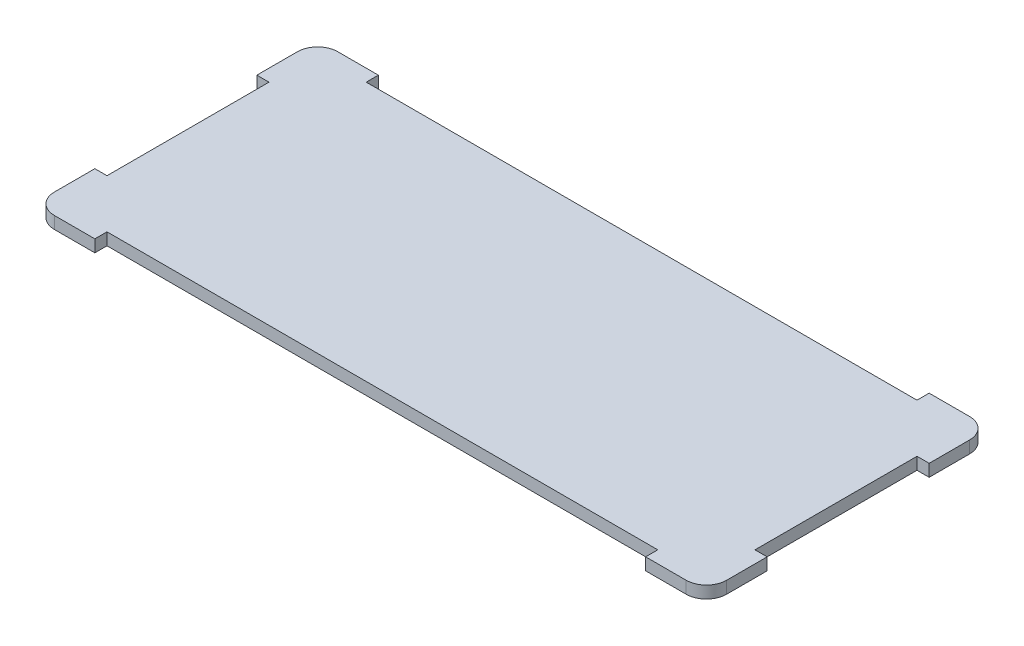
ISO-10303-21;
HEADER;
FILE_DESCRIPTION(('STEP AP214'),'2;1');
FILE_NAME('part.step','',(''),(''),'','','');
FILE_SCHEMA(('AUTOMOTIVE_DESIGN { 1 0 10303 214 1 1 1 1 }'));
ENDSEC;
DATA;
#1=APPLICATION_CONTEXT('core data for automotive mechanical design processes');
#2=APPLICATION_PROTOCOL_DEFINITION('international standard','automotive_design',2000,#1);
#3=PRODUCT_CONTEXT('',#1,'mechanical');
#4=PRODUCT('Part','Part','',(#3));
#5=PRODUCT_RELATED_PRODUCT_CATEGORY('part','',(#4));
#6=PRODUCT_DEFINITION_FORMATION('','',#4);
#7=PRODUCT_DEFINITION_CONTEXT('part definition',#1,'design');
#8=PRODUCT_DEFINITION('design','',#6,#7);
#9=PRODUCT_DEFINITION_SHAPE('','',#8);
#10=(LENGTH_UNIT() NAMED_UNIT(*) SI_UNIT(.MILLI.,.METRE.));
#11=(NAMED_UNIT(*) PLANE_ANGLE_UNIT() SI_UNIT($,.RADIAN.));
#12=(NAMED_UNIT(*) SI_UNIT($,.STERADIAN.) SOLID_ANGLE_UNIT());
#13=UNCERTAINTY_MEASURE_WITH_UNIT(LENGTH_MEASURE(1.E-05),#10,'distance_accuracy_value','');
#14=(GEOMETRIC_REPRESENTATION_CONTEXT(3) GLOBAL_UNCERTAINTY_ASSIGNED_CONTEXT((#13)) GLOBAL_UNIT_ASSIGNED_CONTEXT((#10,
#11,#12)) REPRESENTATION_CONTEXT('',''));
#15=CARTESIAN_POINT('',(0.,0.,0.));
#16=DIRECTION('',(0.,0.,1.));
#17=DIRECTION('',(1.,0.,0.));
#18=AXIS2_PLACEMENT_3D('',#15,#16,#17);
#19=CARTESIAN_POINT('',(-83.3544303797468,-0.0100000000000031,19.1518987341772));
#20=DIRECTION('',(0.,0.,-1.));
#21=DIRECTION('',(-1.,0.,0.));
#22=AXIS2_PLACEMENT_3D('',#19,#20,#21);
#23=PLANE('',#22);
#24=DIRECTION('',(0.,1.,0.));
#25=VECTOR('',#24,1.);
#26=CARTESIAN_POINT('',(52.6371308016878,-0.0100000000000031,19.1518987341772));
#27=LINE('',#26,#25);
#28=CARTESIAN_POINT('',(52.6371308016878,0.,19.1518987341772));
#29=VERTEX_POINT('',#28);
#30=CARTESIAN_POINT('',(52.6371308016878,3.,19.1518987341772));
#31=VERTEX_POINT('',#30);
#32=EDGE_CURVE('E36',#29,#31,#27,.T.);
#33=ORIENTED_EDGE('',*,*,#32,.T.);
#34=DIRECTION('',(-1.,0.,0.));
#35=VECTOR('',#34,1.);
#36=CARTESIAN_POINT('',(0.,3.,19.1518987341772));
#37=LINE('',#36,#35);
#38=CARTESIAN_POINT('',(-83.3544303797468,3.,19.1518987341772));
#39=VERTEX_POINT('',#38);
#40=EDGE_CURVE('E288',#31,#39,#37,.T.);
#41=ORIENTED_EDGE('',*,*,#40,.T.);
#42=DIRECTION('',(0.,1.,0.));
#43=VECTOR('',#42,1.);
#44=CARTESIAN_POINT('',(-83.3544303797468,-0.0100000000000031,19.1518987341772));
#45=LINE('',#44,#43);
#46=CARTESIAN_POINT('',(-83.3544303797468,0.,19.1518987341772));
#47=VERTEX_POINT('',#46);
#48=EDGE_CURVE('E253',#47,#39,#45,.T.);
#49=ORIENTED_EDGE('',*,*,#48,.F.);
#50=DIRECTION('',(-1.,0.,0.));
#51=VECTOR('',#50,1.);
#52=CARTESIAN_POINT('',(0.,0.,19.1518987341772));
#53=LINE('',#52,#51);
#54=EDGE_CURVE('E325',#29,#47,#53,.T.);
#55=ORIENTED_EDGE('',*,*,#54,.F.);
#56=EDGE_LOOP('',(#33,#41,#49,#55));
#57=FACE_BOUND('',#56,.T.);
#58=ADVANCED_FACE('F32',(#57),#23,.F.);
#59=CARTESIAN_POINT('',(52.6371308016878,-0.0100000000000031,22.1518987341772));
#60=DIRECTION('',(1.,0.,0.));
#61=DIRECTION('',(0.,0.,-1.));
#62=AXIS2_PLACEMENT_3D('',#59,#60,#61);
#63=PLANE('',#62);
#64=DIRECTION('',(0.,-1.,0.));
#65=VECTOR('',#64,1.);
#66=CARTESIAN_POINT('',(52.6371308016877,50.,22.1518987341772));
#67=LINE('',#66,#65);
#68=CARTESIAN_POINT('',(52.6371308016877,3.,22.1518987341772));
#69=VERTEX_POINT('',#68);
#70=CARTESIAN_POINT('',(52.6371308016878,0.,22.1518987341772));
#71=VERTEX_POINT('',#70);
#72=EDGE_CURVE('E273',#69,#71,#67,.T.);
#73=ORIENTED_EDGE('',*,*,#72,.F.);
#74=DIRECTION('',(0.,0.,-1.));
#75=VECTOR('',#74,1.);
#76=CARTESIAN_POINT('',(52.6371308016879,3.,2.43495644026E-13));
#77=LINE('',#76,#75);
#78=EDGE_CURVE('E285',#69,#31,#77,.T.);
#79=ORIENTED_EDGE('',*,*,#78,.T.);
#80=ORIENTED_EDGE('',*,*,#32,.F.);
#81=DIRECTION('',(0.,0.,-1.));
#82=VECTOR('',#81,1.);
#83=CARTESIAN_POINT('',(52.6371308016879,0.,2.43495644026E-13));
#84=LINE('',#83,#82);
#85=EDGE_CURVE('E373',#71,#29,#84,.T.);
#86=ORIENTED_EDGE('',*,*,#85,.F.);
#87=EDGE_LOOP('',(#73,#79,#80,#86));
#88=FACE_BOUND('',#87,.T.);
#89=ADVANCED_FACE('F397',(#88),#63,.F.);
#90=CARTESIAN_POINT('',(-83.3544303797468,-0.0100000000000031,22.1518987341772));
#91=DIRECTION('',(-1.,0.,0.));
#92=DIRECTION('',(0.,0.,1.));
#93=AXIS2_PLACEMENT_3D('',#90,#91,#92);
#94=PLANE('',#93);
#95=ORIENTED_EDGE('',*,*,#48,.T.);
#96=DIRECTION('',(0.,0.,1.));
#97=VECTOR('',#96,1.);
#98=CARTESIAN_POINT('',(-83.3544303797468,3.,0.));
#99=LINE('',#98,#97);
#100=CARTESIAN_POINT('',(-83.3544303797468,3.,22.1518987341772));
#101=VERTEX_POINT('',#100);
#102=EDGE_CURVE('E266',#39,#101,#99,.T.);
#103=ORIENTED_EDGE('',*,*,#102,.T.);
#104=DIRECTION('',(0.,1.,0.));
#105=VECTOR('',#104,1.);
#106=CARTESIAN_POINT('',(-83.3544303797468,-0.0100000000000031,22.1518987341772));
#107=LINE('',#106,#105);
#108=CARTESIAN_POINT('',(-83.3544303797468,0.,22.1518987341772));
#109=VERTEX_POINT('',#108);
#110=EDGE_CURVE('E321',#109,#101,#107,.T.);
#111=ORIENTED_EDGE('',*,*,#110,.F.);
#112=DIRECTION('',(0.,0.,1.));
#113=VECTOR('',#112,1.);
#114=CARTESIAN_POINT('',(-83.3544303797468,0.,0.));
#115=LINE('',#114,#113);
#116=EDGE_CURVE('E278',#47,#109,#115,.T.);
#117=ORIENTED_EDGE('',*,*,#116,.F.);
#118=EDGE_LOOP('',(#95,#103,#111,#117));
#119=FACE_BOUND('',#118,.T.);
#120=ADVANCED_FACE('F385',(#119),#94,.F.);
#121=CARTESIAN_POINT('',(64.6371308016878,-0.0100000000000031,7.15189873417722));
#122=DIRECTION('',(0.,0.,1.));
#123=DIRECTION('',(1.,0.,0.));
#124=AXIS2_PLACEMENT_3D('',#121,#122,#123);
#125=PLANE('',#124);
#126=DIRECTION('',(0.,1.,0.));
#127=VECTOR('',#126,1.);
#128=CARTESIAN_POINT('',(64.6371308016878,-0.0100000000000031,7.15189873417722));
#129=LINE('',#128,#127);
#130=CARTESIAN_POINT('',(64.6371308016878,0.,7.15189873417722));
#131=VERTEX_POINT('',#130);
#132=CARTESIAN_POINT('',(64.6371308016878,3.,7.15189873417722));
#133=VERTEX_POINT('',#132);
#134=EDGE_CURVE('E295',#131,#133,#129,.T.);
#135=ORIENTED_EDGE('',*,*,#134,.T.);
#136=DIRECTION('',(1.,0.,0.));
#137=VECTOR('',#136,1.);
#138=CARTESIAN_POINT('',(0.,3.,7.15189873417722));
#139=LINE('',#138,#137);
#140=CARTESIAN_POINT('',(67.6371308016878,3.,7.15189873417722));
#141=VERTEX_POINT('',#140);
#142=EDGE_CURVE('E289',#133,#141,#139,.T.);
#143=ORIENTED_EDGE('',*,*,#142,.T.);
#144=DIRECTION('',(0.,1.,0.));
#145=VECTOR('',#144,1.);
#146=CARTESIAN_POINT('',(67.6371308016878,-0.0100000000000031,7.15189873417722));
#147=LINE('',#146,#145);
#148=CARTESIAN_POINT('',(67.6371308016878,0.,7.15189873417722));
#149=VERTEX_POINT('',#148);
#150=EDGE_CURVE('E247',#149,#141,#147,.T.);
#151=ORIENTED_EDGE('',*,*,#150,.F.);
#152=DIRECTION('',(1.,0.,0.));
#153=VECTOR('',#152,1.);
#154=CARTESIAN_POINT('',(0.,0.,7.15189873417722));
#155=LINE('',#154,#153);
#156=EDGE_CURVE('E322',#131,#149,#155,.T.);
#157=ORIENTED_EDGE('',*,*,#156,.F.);
#158=EDGE_LOOP('',(#135,#143,#151,#157));
#159=FACE_BOUND('',#158,.T.);
#160=ADVANCED_FACE('F412',(#159),#125,.F.);
#161=CARTESIAN_POINT('',(64.6371308016878,-0.0100000000000031,-32.8481012658228));
#162=DIRECTION('',(0.,0.,-1.));
#163=DIRECTION('',(-1.,0.,0.));
#164=AXIS2_PLACEMENT_3D('',#161,#162,#163);
#165=PLANE('',#164);
#166=DIRECTION('',(0.,-1.,0.));
#167=VECTOR('',#166,1.);
#168=CARTESIAN_POINT('',(67.6371308016878,50.,-32.8481012658228));
#169=LINE('',#168,#167);
#170=CARTESIAN_POINT('',(67.6371308016878,3.,-32.8481012658228));
#171=VERTEX_POINT('',#170);
#172=CARTESIAN_POINT('',(67.6371308016878,0.,-32.8481012658228));
#173=VERTEX_POINT('',#172);
#174=EDGE_CURVE('E318',#171,#173,#169,.T.);
#175=ORIENTED_EDGE('',*,*,#174,.F.);
#176=DIRECTION('',(-1.,0.,0.));
#177=VECTOR('',#176,1.);
#178=CARTESIAN_POINT('',(0.,3.,-32.8481012658228));
#179=LINE('',#178,#177);
#180=CARTESIAN_POINT('',(64.6371308016878,3.,-32.8481012658228));
#181=VERTEX_POINT('',#180);
#182=EDGE_CURVE('E241',#171,#181,#179,.T.);
#183=ORIENTED_EDGE('',*,*,#182,.T.);
#184=DIRECTION('',(0.,1.,0.));
#185=VECTOR('',#184,1.);
#186=CARTESIAN_POINT('',(64.6371308016878,-0.0100000000000031,-32.8481012658228));
#187=LINE('',#186,#185);
#188=CARTESIAN_POINT('',(64.6371308016878,0.,-32.8481012658228));
#189=VERTEX_POINT('',#188);
#190=EDGE_CURVE('E220',#189,#181,#187,.T.);
#191=ORIENTED_EDGE('',*,*,#190,.F.);
#192=DIRECTION('',(-1.,0.,0.));
#193=VECTOR('',#192,1.);
#194=CARTESIAN_POINT('',(0.,0.,-32.8481012658228));
#195=LINE('',#194,#193);
#196=EDGE_CURVE('E248',#173,#189,#195,.T.);
#197=ORIENTED_EDGE('',*,*,#196,.F.);
#198=EDGE_LOOP('',(#175,#183,#191,#197));
#199=FACE_BOUND('',#198,.T.);
#200=ADVANCED_FACE('F414',(#199),#165,.F.);
#201=CARTESIAN_POINT('',(64.6371308016878,-0.0100000000000031,7.15189873417722));
#202=DIRECTION('',(-1.,0.,0.));
#203=DIRECTION('',(0.,0.,1.));
#204=AXIS2_PLACEMENT_3D('',#201,#202,#203);
#205=PLANE('',#204);
#206=ORIENTED_EDGE('',*,*,#190,.T.);
#207=DIRECTION('',(0.,0.,1.));
#208=VECTOR('',#207,1.);
#209=CARTESIAN_POINT('',(64.6371308016878,3.,0.));
#210=LINE('',#209,#208);
#211=EDGE_CURVE('E314',#181,#133,#210,.T.);
#212=ORIENTED_EDGE('',*,*,#211,.T.);
#213=ORIENTED_EDGE('',*,*,#134,.F.);
#214=DIRECTION('',(0.,0.,1.));
#215=VECTOR('',#214,1.);
#216=CARTESIAN_POINT('',(64.6371308016878,0.,0.));
#217=LINE('',#216,#215);
#218=EDGE_CURVE('E324',#189,#131,#217,.T.);
#219=ORIENTED_EDGE('',*,*,#218,.F.);
#220=EDGE_LOOP('',(#206,#212,#213,#219));
#221=FACE_BOUND('',#220,.T.);
#222=ADVANCED_FACE('F420',(#221),#205,.F.);
#223=CARTESIAN_POINT('',(52.6371308016878,-0.0100000000000031,-44.8481012658228));
#224=DIRECTION('',(0.,0.,1.));
#225=DIRECTION('',(1.,0.,0.));
#226=AXIS2_PLACEMENT_3D('',#223,#224,#225);
#227=PLANE('',#226);
#228=DIRECTION('',(0.,1.,0.));
#229=VECTOR('',#228,1.);
#230=CARTESIAN_POINT('',(-83.3544303797469,-0.0100000000000031,-44.8481012658228));
#231=LINE('',#230,#229);
#232=CARTESIAN_POINT('',(-83.3544303797469,0.,-44.8481012658228));
#233=VERTEX_POINT('',#232);
#234=CARTESIAN_POINT('',(-83.3544303797469,3.,-44.8481012658228));
#235=VERTEX_POINT('',#234);
#236=EDGE_CURVE('E200',#233,#235,#231,.T.);
#237=ORIENTED_EDGE('',*,*,#236,.T.);
#238=DIRECTION('',(1.,0.,0.));
#239=VECTOR('',#238,1.);
#240=CARTESIAN_POINT('',(0.,3.,-44.8481012658228));
#241=LINE('',#240,#239);
#242=CARTESIAN_POINT('',(52.6371308016878,3.,-44.8481012658228));
#243=VERTEX_POINT('',#242);
#244=EDGE_CURVE('E234',#235,#243,#241,.T.);
#245=ORIENTED_EDGE('',*,*,#244,.T.);
#246=DIRECTION('',(0.,1.,0.));
#247=VECTOR('',#246,1.);
#248=CARTESIAN_POINT('',(52.6371308016878,-0.0100000000000031,-44.8481012658228));
#249=LINE('',#248,#247);
#250=CARTESIAN_POINT('',(52.6371308016878,0.,-44.8481012658228));
#251=VERTEX_POINT('',#250);
#252=EDGE_CURVE('E203',#251,#243,#249,.T.);
#253=ORIENTED_EDGE('',*,*,#252,.F.);
#254=DIRECTION('',(1.,0.,0.));
#255=VECTOR('',#254,1.);
#256=CARTESIAN_POINT('',(0.,0.,-44.8481012658228));
#257=LINE('',#256,#255);
#258=EDGE_CURVE('E196',#233,#251,#257,.T.);
#259=ORIENTED_EDGE('',*,*,#258,.F.);
#260=EDGE_LOOP('',(#237,#245,#253,#259));
#261=FACE_BOUND('',#260,.T.);
#262=ADVANCED_FACE('F198',(#261),#227,.F.);
#263=CARTESIAN_POINT('',(-83.3544303797469,-0.0100000000000031,-44.8481012658228));
#264=DIRECTION('',(-1.,0.,0.));
#265=DIRECTION('',(0.,0.,1.));
#266=AXIS2_PLACEMENT_3D('',#263,#264,#265);
#267=PLANE('',#266);
#268=DIRECTION('',(0.,-1.,0.));
#269=VECTOR('',#268,1.);
#270=CARTESIAN_POINT('',(-83.3544303797469,50.,-47.8481012658228));
#271=LINE('',#270,#269);
#272=CARTESIAN_POINT('',(-83.3544303797469,3.,-47.8481012658228));
#273=VERTEX_POINT('',#272);
#274=CARTESIAN_POINT('',(-83.3544303797469,0.,-47.8481012658228));
#275=VERTEX_POINT('',#274);
#276=EDGE_CURVE('E244',#273,#275,#271,.T.);
#277=ORIENTED_EDGE('',*,*,#276,.F.);
#278=DIRECTION('',(0.,0.,1.));
#279=VECTOR('',#278,1.);
#280=CARTESIAN_POINT('',(-83.3544303797469,3.,0.));
#281=LINE('',#280,#279);
#282=EDGE_CURVE('E218',#273,#235,#281,.T.);
#283=ORIENTED_EDGE('',*,*,#282,.T.);
#284=ORIENTED_EDGE('',*,*,#236,.F.);
#285=DIRECTION('',(0.,0.,1.));
#286=VECTOR('',#285,1.);
#287=CARTESIAN_POINT('',(-83.3544303797469,0.,0.));
#288=LINE('',#287,#286);
#289=EDGE_CURVE('E207',#275,#233,#288,.T.);
#290=ORIENTED_EDGE('',*,*,#289,.F.);
#291=EDGE_LOOP('',(#277,#283,#284,#290));
#292=FACE_BOUND('',#291,.T.);
#293=ADVANCED_FACE('F217',(#292),#267,.F.);
#294=CARTESIAN_POINT('',(52.6371308016878,-0.0100000000000031,-44.8481012658228));
#295=DIRECTION('',(1.,0.,0.));
#296=DIRECTION('',(0.,0.,-1.));
#297=AXIS2_PLACEMENT_3D('',#294,#295,#296);
#298=PLANE('',#297);
#299=ORIENTED_EDGE('',*,*,#252,.T.);
#300=DIRECTION('',(0.,0.,-1.));
#301=VECTOR('',#300,1.);
#302=CARTESIAN_POINT('',(52.6371308016878,3.,0.));
#303=LINE('',#302,#301);
#304=CARTESIAN_POINT('',(52.6371308016878,3.,-47.8481012658228));
#305=VERTEX_POINT('',#304);
#306=EDGE_CURVE('E238',#243,#305,#303,.T.);
#307=ORIENTED_EDGE('',*,*,#306,.T.);
#308=DIRECTION('',(0.,1.,0.));
#309=VECTOR('',#308,1.);
#310=CARTESIAN_POINT('',(52.6371308016878,-0.0100000000000031,-47.8481012658228));
#311=LINE('',#310,#309);
#312=CARTESIAN_POINT('',(52.6371308016878,0.,-47.8481012658228));
#313=VERTEX_POINT('',#312);
#314=EDGE_CURVE('E242',#313,#305,#311,.T.);
#315=ORIENTED_EDGE('',*,*,#314,.F.);
#316=DIRECTION('',(0.,0.,-1.));
#317=VECTOR('',#316,1.);
#318=CARTESIAN_POINT('',(52.6371308016878,0.,0.));
#319=LINE('',#318,#317);
#320=EDGE_CURVE('E215',#251,#313,#319,.T.);
#321=ORIENTED_EDGE('',*,*,#320,.F.);
#322=EDGE_LOOP('',(#299,#307,#315,#321));
#323=FACE_BOUND('',#322,.T.);
#324=ADVANCED_FACE('F567',(#323),#298,.F.);
#325=CARTESIAN_POINT('',(-98.3544303797468,-0.0100000000000031,7.15189873417722));
#326=DIRECTION('',(0.,0.,1.));
#327=DIRECTION('',(1.,0.,0.));
#328=AXIS2_PLACEMENT_3D('',#325,#326,#327);
#329=PLANE('',#328);
#330=DIRECTION('',(0.,-1.,0.));
#331=VECTOR('',#330,1.);
#332=CARTESIAN_POINT('',(-98.3544303797468,50.,7.15189873417722));
#333=LINE('',#332,#331);
#334=CARTESIAN_POINT('',(-98.3544303797468,3.,7.15189873417722));
#335=VERTEX_POINT('',#334);
#336=CARTESIAN_POINT('',(-98.3544303797468,0.,7.15189873417722));
#337=VERTEX_POINT('',#336);
#338=EDGE_CURVE('E206',#335,#337,#333,.T.);
#339=ORIENTED_EDGE('',*,*,#338,.F.);
#340=DIRECTION('',(1.,0.,0.));
#341=VECTOR('',#340,1.);
#342=CARTESIAN_POINT('',(0.,3.,7.15189873417733));
#343=LINE('',#342,#341);
#344=CARTESIAN_POINT('',(-95.3544303797468,3.,7.15189873417722));
#345=VERTEX_POINT('',#344);
#346=EDGE_CURVE('E245',#335,#345,#343,.T.);
#347=ORIENTED_EDGE('',*,*,#346,.T.);
#348=DIRECTION('',(0.,1.,0.));
#349=VECTOR('',#348,1.);
#350=CARTESIAN_POINT('',(-95.3544303797468,-0.0100000000000031,7.15189873417722));
#351=LINE('',#350,#349);
#352=CARTESIAN_POINT('',(-95.3544303797468,0.,7.15189873417722));
#353=VERTEX_POINT('',#352);
#354=EDGE_CURVE('E236',#353,#345,#351,.T.);
#355=ORIENTED_EDGE('',*,*,#354,.F.);
#356=DIRECTION('',(1.,0.,0.));
#357=VECTOR('',#356,1.);
#358=CARTESIAN_POINT('',(0.,0.,7.15189873417733));
#359=LINE('',#358,#357);
#360=EDGE_CURVE('E270',#337,#353,#359,.T.);
#361=ORIENTED_EDGE('',*,*,#360,.F.);
#362=EDGE_LOOP('',(#339,#347,#355,#361));
#363=FACE_BOUND('',#362,.T.);
#364=ADVANCED_FACE('F462',(#363),#329,.F.);
#365=CARTESIAN_POINT('',(-98.3544303797468,-0.0100000000000031,-32.8481012658228));
#366=DIRECTION('',(0.,0.,-1.));
#367=DIRECTION('',(-1.,0.,0.));
#368=AXIS2_PLACEMENT_3D('',#365,#366,#367);
#369=PLANE('',#368);
#370=DIRECTION('',(0.,1.,0.));
#371=VECTOR('',#370,1.);
#372=CARTESIAN_POINT('',(-95.3544303797468,-0.0100000000000031,-32.8481012658228));
#373=LINE('',#372,#371);
#374=CARTESIAN_POINT('',(-95.3544303797468,0.,-32.8481012658228));
#375=VERTEX_POINT('',#374);
#376=CARTESIAN_POINT('',(-95.3544303797468,3.,-32.8481012658228));
#377=VERTEX_POINT('',#376);
#378=EDGE_CURVE('E250',#375,#377,#373,.T.);
#379=ORIENTED_EDGE('',*,*,#378,.T.);
#380=DIRECTION('',(-1.,0.,0.));
#381=VECTOR('',#380,1.);
#382=CARTESIAN_POINT('',(0.,3.,-32.8481012658228));
#383=LINE('',#382,#381);
#384=CARTESIAN_POINT('',(-98.3544303797468,3.,-32.8481012658228));
#385=VERTEX_POINT('',#384);
#386=EDGE_CURVE('E262',#377,#385,#383,.T.);
#387=ORIENTED_EDGE('',*,*,#386,.T.);
#388=DIRECTION('',(0.,1.,0.));
#389=VECTOR('',#388,1.);
#390=CARTESIAN_POINT('',(-98.3544303797468,50.,-32.8481012658228));
#391=LINE('',#390,#389);
#392=CARTESIAN_POINT('',(-98.3544303797468,0.,-32.8481012658228));
#393=VERTEX_POINT('',#392);
#394=EDGE_CURVE('E280',#393,#385,#391,.T.);
#395=ORIENTED_EDGE('',*,*,#394,.F.);
#396=DIRECTION('',(-1.,0.,0.));
#397=VECTOR('',#396,1.);
#398=CARTESIAN_POINT('',(0.,0.,-32.8481012658228));
#399=LINE('',#398,#397);
#400=EDGE_CURVE('E276',#375,#393,#399,.T.);
#401=ORIENTED_EDGE('',*,*,#400,.F.);
#402=EDGE_LOOP('',(#379,#387,#395,#401));
#403=FACE_BOUND('',#402,.T.);
#404=ADVANCED_FACE('F456',(#403),#369,.F.);
#405=CARTESIAN_POINT('',(-95.3544303797468,-0.0100000000000031,-32.8481012658228));
#406=DIRECTION('',(1.,0.,0.));
#407=DIRECTION('',(0.,0.,-1.));
#408=AXIS2_PLACEMENT_3D('',#405,#406,#407);
#409=PLANE('',#408);
#410=ORIENTED_EDGE('',*,*,#354,.T.);
#411=DIRECTION('',(0.,0.,-1.));
#412=VECTOR('',#411,1.);
#413=CARTESIAN_POINT('',(-95.3544303797468,3.,0.));
#414=LINE('',#413,#412);
#415=EDGE_CURVE('E265',#345,#377,#414,.T.);
#416=ORIENTED_EDGE('',*,*,#415,.T.);
#417=ORIENTED_EDGE('',*,*,#378,.F.);
#418=DIRECTION('',(0.,0.,-1.));
#419=VECTOR('',#418,1.);
#420=CARTESIAN_POINT('',(-95.3544303797468,0.,0.));
#421=LINE('',#420,#419);
#422=EDGE_CURVE('E272',#353,#375,#421,.T.);
#423=ORIENTED_EDGE('',*,*,#422,.F.);
#424=EDGE_LOOP('',(#410,#416,#417,#423));
#425=FACE_BOUND('',#424,.T.);
#426=ADVANCED_FACE('F451',(#425),#409,.F.);
#427=CARTESIAN_POINT('',(-98.3544303797468,50.,22.1518987341772));
#428=DIRECTION('',(0.,0.,-1.));
#429=DIRECTION('',(-1.,0.,0.));
#430=AXIS2_PLACEMENT_3D('',#427,#428,#429);
#431=PLANE('',#430);
#432=DIRECTION('',(1.,0.,0.));
#433=VECTOR('',#432,1.);
#434=CARTESIAN_POINT('',(-98.3544303797468,0.,22.1518987341772));
#435=LINE('',#434,#433);
#436=CARTESIAN_POINT('',(-93.3544303797468,0.,22.1518987341772));
#437=VERTEX_POINT('',#436);
#438=EDGE_CURVE('E329',#437,#109,#435,.T.);
#439=ORIENTED_EDGE('',*,*,#438,.T.);
#440=ORIENTED_EDGE('',*,*,#110,.T.);
#441=DIRECTION('',(-1.,0.,0.));
#442=VECTOR('',#441,1.);
#443=CARTESIAN_POINT('',(-98.3544303797468,3.,22.1518987341772));
#444=LINE('',#443,#442);
#445=CARTESIAN_POINT('',(-93.3544303797468,3.,22.1518987341772));
#446=VERTEX_POINT('',#445);
#447=EDGE_CURVE('E312',#101,#446,#444,.T.);
#448=ORIENTED_EDGE('',*,*,#447,.T.);
#449=DIRECTION('',(0.,-1.,0.));
#450=VECTOR('',#449,1.);
#451=CARTESIAN_POINT('',(-93.3544303797468,50.,22.1518987341772));
#452=LINE('',#451,#450);
#453=EDGE_CURVE('E354',#446,#437,#452,.T.);
#454=ORIENTED_EDGE('',*,*,#453,.T.);
#455=EDGE_LOOP('',(#439,#440,#448,#454));
#456=FACE_BOUND('',#455,.T.);
#457=ADVANCED_FACE('F381',(#456),#431,.F.);
#458=CARTESIAN_POINT('',(62.6371308016878,3.,22.1518987341772));
#459=VERTEX_POINT('',#458);
#460=EDGE_CURVE('E362',#459,#69,#444,.T.);
#461=ORIENTED_EDGE('',*,*,#460,.T.);
#462=ORIENTED_EDGE('',*,*,#72,.T.);
#463=CARTESIAN_POINT('',(62.6371308016878,0.,22.1518987341772));
#464=VERTEX_POINT('',#463);
#465=EDGE_CURVE('E256',#71,#464,#435,.T.);
#466=ORIENTED_EDGE('',*,*,#465,.T.);
#467=DIRECTION('',(0.,-1.,0.));
#468=VECTOR('',#467,1.);
#469=CARTESIAN_POINT('',(62.6371308016878,50.,22.1518987341772));
#470=LINE('',#469,#468);
#471=EDGE_CURVE('E356',#464,#459,#470,.F.);
#472=ORIENTED_EDGE('',*,*,#471,.T.);
#473=EDGE_LOOP('',(#461,#462,#466,#472));
#474=FACE_BOUND('',#473,.T.);
#475=ADVANCED_FACE('F400',(#474),#431,.F.);
#476=CARTESIAN_POINT('',(62.6371308016878,50.,17.1518987341772));
#477=DIRECTION('',(0.,-1.,0.));
#478=DIRECTION('',(0.,0.,-1.));
#479=AXIS2_PLACEMENT_3D('',#476,#477,#478);
#480=CYLINDRICAL_SURFACE('',#479,5.);
#481=CARTESIAN_POINT('',(62.6371308016878,3.,17.1518987341772));
#482=DIRECTION('',(0.,-1.,0.));
#483=DIRECTION('',(0.,0.,-1.));
#484=AXIS2_PLACEMENT_3D('',#481,#482,#483);
#485=CIRCLE('',#484,5.);
#486=CARTESIAN_POINT('',(67.6371308016878,3.,17.1518987341772));
#487=VERTEX_POINT('',#486);
#488=EDGE_CURVE('E361',#459,#487,#485,.F.);
#489=ORIENTED_EDGE('',*,*,#488,.F.);
#490=ORIENTED_EDGE('',*,*,#471,.F.);
#491=CARTESIAN_POINT('',(62.6371308016878,0.,17.1518987341772));
#492=DIRECTION('',(0.,1.,0.));
#493=DIRECTION('',(0.,0.,1.));
#494=AXIS2_PLACEMENT_3D('',#491,#492,#493);
#495=CIRCLE('',#494,5.);
#496=CARTESIAN_POINT('',(67.6371308016878,0.,17.1518987341772));
#497=VERTEX_POINT('',#496);
#498=EDGE_CURVE('E336',#497,#464,#495,.F.);
#499=ORIENTED_EDGE('',*,*,#498,.F.);
#500=DIRECTION('',(0.,-1.,0.));
#501=VECTOR('',#500,1.);
#502=CARTESIAN_POINT('',(67.6371308016878,50.,17.1518987341772));
#503=LINE('',#502,#501);
#504=EDGE_CURVE('E349',#487,#497,#503,.T.);
#505=ORIENTED_EDGE('',*,*,#504,.F.);
#506=EDGE_LOOP('',(#489,#490,#499,#505));
#507=FACE_BOUND('',#506,.T.);
#508=ADVANCED_FACE('F404',(#507),#480,.T.);
#509=CARTESIAN_POINT('',(67.6371308016878,50.,-47.8481012658228));
#510=DIRECTION('',(-1.,0.,0.));
#511=DIRECTION('',(0.,0.,1.));
#512=AXIS2_PLACEMENT_3D('',#509,#510,#511);
#513=PLANE('',#512);
#514=DIRECTION('',(0.,0.,-1.));
#515=VECTOR('',#514,1.);
#516=CARTESIAN_POINT('',(67.6371308016878,0.,-47.8481012658228));
#517=LINE('',#516,#515);
#518=EDGE_CURVE('E305',#497,#149,#517,.T.);
#519=ORIENTED_EDGE('',*,*,#518,.T.);
#520=ORIENTED_EDGE('',*,*,#150,.T.);
#521=DIRECTION('',(0.,0.,1.));
#522=VECTOR('',#521,1.);
#523=CARTESIAN_POINT('',(67.6371308016878,3.,-47.8481012658228));
#524=LINE('',#523,#522);
#525=EDGE_CURVE('E233',#141,#487,#524,.T.);
#526=ORIENTED_EDGE('',*,*,#525,.T.);
#527=ORIENTED_EDGE('',*,*,#504,.T.);
#528=EDGE_LOOP('',(#519,#520,#526,#527));
#529=FACE_BOUND('',#528,.T.);
#530=ADVANCED_FACE('F410',(#529),#513,.F.);
#531=CARTESIAN_POINT('',(67.6371308016878,3.,-42.8481012658228));
#532=VERTEX_POINT('',#531);
#533=EDGE_CURVE('E309',#532,#171,#524,.T.);
#534=ORIENTED_EDGE('',*,*,#533,.T.);
#535=ORIENTED_EDGE('',*,*,#174,.T.);
#536=CARTESIAN_POINT('',(67.6371308016878,0.,-42.8481012658228));
#537=VERTEX_POINT('',#536);
#538=EDGE_CURVE('E308',#173,#537,#517,.T.);
#539=ORIENTED_EDGE('',*,*,#538,.T.);
#540=DIRECTION('',(0.,-1.,0.));
#541=VECTOR('',#540,1.);
#542=CARTESIAN_POINT('',(67.6371308016878,50.,-42.8481012658228));
#543=LINE('',#542,#541);
#544=EDGE_CURVE('E351',#537,#532,#543,.F.);
#545=ORIENTED_EDGE('',*,*,#544,.T.);
#546=EDGE_LOOP('',(#534,#535,#539,#545));
#547=FACE_BOUND('',#546,.T.);
#548=ADVANCED_FACE('F443',(#547),#513,.F.);
#549=CARTESIAN_POINT('',(62.6371308016877,50.,-42.8481012658228));
#550=DIRECTION('',(0.,-1.,0.));
#551=DIRECTION('',(0.,0.,-1.));
#552=AXIS2_PLACEMENT_3D('',#549,#550,#551);
#553=CYLINDRICAL_SURFACE('',#552,5.);
#554=CARTESIAN_POINT('',(62.6371308016877,3.,-42.8481012658228));
#555=DIRECTION('',(0.,-1.,0.));
#556=DIRECTION('',(0.,0.,-1.));
#557=AXIS2_PLACEMENT_3D('',#554,#555,#556);
#558=CIRCLE('',#557,5.);
#559=CARTESIAN_POINT('',(62.6371308016877,3.,-47.8481012658228));
#560=VERTEX_POINT('',#559);
#561=EDGE_CURVE('E367',#532,#560,#558,.F.);
#562=ORIENTED_EDGE('',*,*,#561,.F.);
#563=ORIENTED_EDGE('',*,*,#544,.F.);
#564=CARTESIAN_POINT('',(62.6371308016877,0.,-42.8481012658228));
#565=DIRECTION('',(0.,1.,0.));
#566=DIRECTION('',(0.,0.,1.));
#567=AXIS2_PLACEMENT_3D('',#564,#565,#566);
#568=CIRCLE('',#567,5.);
#569=CARTESIAN_POINT('',(62.6371308016877,0.,-47.8481012658228));
#570=VERTEX_POINT('',#569);
#571=EDGE_CURVE('E339',#570,#537,#568,.F.);
#572=ORIENTED_EDGE('',*,*,#571,.F.);
#573=DIRECTION('',(0.,-1.,0.));
#574=VECTOR('',#573,1.);
#575=CARTESIAN_POINT('',(62.6371308016877,50.,-47.8481012658228));
#576=LINE('',#575,#574);
#577=EDGE_CURVE('E344',#560,#570,#576,.T.);
#578=ORIENTED_EDGE('',*,*,#577,.F.);
#579=EDGE_LOOP('',(#562,#563,#572,#578));
#580=FACE_BOUND('',#579,.T.);
#581=ADVANCED_FACE('F439',(#580),#553,.T.);
#582=CARTESIAN_POINT('',(-98.3544303797468,50.,-47.8481012658228));
#583=DIRECTION('',(0.,0.,1.));
#584=DIRECTION('',(1.,0.,0.));
#585=AXIS2_PLACEMENT_3D('',#582,#583,#584);
#586=PLANE('',#585);
#587=DIRECTION('',(-1.,0.,0.));
#588=VECTOR('',#587,1.);
#589=CARTESIAN_POINT('',(-98.3544303797468,0.,-47.8481012658228));
#590=LINE('',#589,#588);
#591=EDGE_CURVE('E225',#570,#313,#590,.T.);
#592=ORIENTED_EDGE('',*,*,#591,.T.);
#593=ORIENTED_EDGE('',*,*,#314,.T.);
#594=DIRECTION('',(1.,0.,0.));
#595=VECTOR('',#594,1.);
#596=CARTESIAN_POINT('',(-98.3544303797468,3.,-47.8481012658228));
#597=LINE('',#596,#595);
#598=EDGE_CURVE('E232',#305,#560,#597,.T.);
#599=ORIENTED_EDGE('',*,*,#598,.T.);
#600=ORIENTED_EDGE('',*,*,#577,.T.);
#601=EDGE_LOOP('',(#592,#593,#599,#600));
#602=FACE_BOUND('',#601,.T.);
#603=ADVANCED_FACE('F442',(#602),#586,.F.);
#604=CARTESIAN_POINT('',(-93.3544303797468,3.,-47.8481012658228));
#605=VERTEX_POINT('',#604);
#606=EDGE_CURVE('E229',#605,#273,#597,.T.);
#607=ORIENTED_EDGE('',*,*,#606,.T.);
#608=ORIENTED_EDGE('',*,*,#276,.T.);
#609=CARTESIAN_POINT('',(-93.3544303797468,0.,-47.8481012658228));
#610=VERTEX_POINT('',#609);
#611=EDGE_CURVE('E211',#275,#610,#590,.T.);
#612=ORIENTED_EDGE('',*,*,#611,.T.);
#613=DIRECTION('',(0.,-1.,0.));
#614=VECTOR('',#613,1.);
#615=CARTESIAN_POINT('',(-93.3544303797468,50.,-47.8481012658228));
#616=LINE('',#615,#614);
#617=EDGE_CURVE('E346',#610,#605,#616,.F.);
#618=ORIENTED_EDGE('',*,*,#617,.T.);
#619=EDGE_LOOP('',(#607,#608,#612,#618));
#620=FACE_BOUND('',#619,.T.);
#621=ADVANCED_FACE('F436',(#620),#586,.F.);
#622=CARTESIAN_POINT('',(-93.3544303797468,50.,17.1518987341772));
#623=DIRECTION('',(0.,-1.,0.));
#624=DIRECTION('',(0.,0.,-1.));
#625=AXIS2_PLACEMENT_3D('',#622,#623,#624);
#626=CYLINDRICAL_SURFACE('',#625,5.);
#627=CARTESIAN_POINT('',(-93.3544303797468,3.,17.1518987341772));
#628=DIRECTION('',(0.,-1.,0.));
#629=DIRECTION('',(0.,0.,-1.));
#630=AXIS2_PLACEMENT_3D('',#627,#628,#629);
#631=CIRCLE('',#630,5.);
#632=CARTESIAN_POINT('',(-98.3544303797468,3.,17.1518987341772));
#633=VERTEX_POINT('',#632);
#634=EDGE_CURVE('E282',#633,#446,#631,.F.);
#635=ORIENTED_EDGE('',*,*,#634,.F.);
#636=DIRECTION('',(0.,-1.,0.));
#637=VECTOR('',#636,1.);
#638=CARTESIAN_POINT('',(-98.3544303797468,50.,17.1518987341772));
#639=LINE('',#638,#637);
#640=CARTESIAN_POINT('',(-98.3544303797468,0.,17.1518987341772));
#641=VERTEX_POINT('',#640);
#642=EDGE_CURVE('E228',#641,#633,#639,.F.);
#643=ORIENTED_EDGE('',*,*,#642,.F.);
#644=CARTESIAN_POINT('',(-93.3544303797468,0.,17.1518987341772));
#645=DIRECTION('',(0.,1.,0.));
#646=DIRECTION('',(0.,0.,1.));
#647=AXIS2_PLACEMENT_3D('',#644,#645,#646);
#648=CIRCLE('',#647,5.);
#649=EDGE_CURVE('E334',#437,#641,#648,.F.);
#650=ORIENTED_EDGE('',*,*,#649,.F.);
#651=ORIENTED_EDGE('',*,*,#453,.F.);
#652=EDGE_LOOP('',(#635,#643,#650,#651));
#653=FACE_BOUND('',#652,.T.);
#654=ADVANCED_FACE('F393',(#653),#626,.T.);
#655=CARTESIAN_POINT('',(-93.3544303797468,50.,-42.8481012658228));
#656=DIRECTION('',(0.,-1.,0.));
#657=DIRECTION('',(0.,0.,-1.));
#658=AXIS2_PLACEMENT_3D('',#655,#656,#657);
#659=CYLINDRICAL_SURFACE('',#658,5.);
#660=CARTESIAN_POINT('',(-93.3544303797468,3.,-42.8481012658228));
#661=DIRECTION('',(0.,-1.,0.));
#662=DIRECTION('',(0.,0.,-1.));
#663=AXIS2_PLACEMENT_3D('',#660,#661,#662);
#664=CIRCLE('',#663,5.);
#665=CARTESIAN_POINT('',(-98.3544303797468,3.,-42.8481012658228));
#666=VERTEX_POINT('',#665);
#667=EDGE_CURVE('E261',#605,#666,#664,.F.);
#668=ORIENTED_EDGE('',*,*,#667,.F.);
#669=ORIENTED_EDGE('',*,*,#617,.F.);
#670=CARTESIAN_POINT('',(-93.3544303797468,0.,-42.8481012658228));
#671=DIRECTION('',(0.,1.,0.));
#672=DIRECTION('',(0.,0.,1.));
#673=AXIS2_PLACEMENT_3D('',#670,#671,#672);
#674=CIRCLE('',#673,5.);
#675=CARTESIAN_POINT('',(-98.3544303797468,0.,-42.8481012658228));
#676=VERTEX_POINT('',#675);
#677=EDGE_CURVE('E342',#676,#610,#674,.F.);
#678=ORIENTED_EDGE('',*,*,#677,.F.);
#679=DIRECTION('',(0.,-1.,0.));
#680=VECTOR('',#679,1.);
#681=CARTESIAN_POINT('',(-98.3544303797468,50.,-42.8481012658228));
#682=LINE('',#681,#680);
#683=EDGE_CURVE('E49',#666,#676,#682,.T.);
#684=ORIENTED_EDGE('',*,*,#683,.F.);
#685=EDGE_LOOP('',(#668,#669,#678,#684));
#686=FACE_BOUND('',#685,.T.);
#687=ADVANCED_FACE('F435',(#686),#659,.T.);
#688=CARTESIAN_POINT('',(0.,3.,0.));
#689=DIRECTION('',(0.,1.,0.));
#690=DIRECTION('',(0.,0.,1.));
#691=AXIS2_PLACEMENT_3D('',#688,#689,#690);
#692=PLANE('',#691);
#693=ORIENTED_EDGE('',*,*,#346,.F.);
#694=DIRECTION('',(0.,0.,-1.));
#695=VECTOR('',#694,1.);
#696=CARTESIAN_POINT('',(-98.3544303797468,3.,-47.8481012658228));
#697=LINE('',#696,#695);
#698=EDGE_CURVE('E257',#633,#335,#697,.T.);
#699=ORIENTED_EDGE('',*,*,#698,.F.);
#700=ORIENTED_EDGE('',*,*,#634,.T.);
#701=ORIENTED_EDGE('',*,*,#447,.F.);
#702=ORIENTED_EDGE('',*,*,#102,.F.);
#703=ORIENTED_EDGE('',*,*,#40,.F.);
#704=ORIENTED_EDGE('',*,*,#78,.F.);
#705=ORIENTED_EDGE('',*,*,#460,.F.);
#706=ORIENTED_EDGE('',*,*,#488,.T.);
#707=ORIENTED_EDGE('',*,*,#525,.F.);
#708=ORIENTED_EDGE('',*,*,#142,.F.);
#709=ORIENTED_EDGE('',*,*,#211,.F.);
#710=ORIENTED_EDGE('',*,*,#182,.F.);
#711=ORIENTED_EDGE('',*,*,#533,.F.);
#712=ORIENTED_EDGE('',*,*,#561,.T.);
#713=ORIENTED_EDGE('',*,*,#598,.F.);
#714=ORIENTED_EDGE('',*,*,#306,.F.);
#715=ORIENTED_EDGE('',*,*,#244,.F.);
#716=ORIENTED_EDGE('',*,*,#282,.F.);
#717=ORIENTED_EDGE('',*,*,#606,.F.);
#718=ORIENTED_EDGE('',*,*,#667,.T.);
#719=EDGE_CURVE('E260',#385,#666,#697,.T.);
#720=ORIENTED_EDGE('',*,*,#719,.F.);
#721=ORIENTED_EDGE('',*,*,#386,.F.);
#722=ORIENTED_EDGE('',*,*,#415,.F.);
#723=EDGE_LOOP('',(#693,#699,#700,#701,#702,#703,#704,#705,#706,#707,#708,#709,#710,#711,#712,
#713,#714,#715,#716,#717,#718,#720,#721,#722));
#724=FACE_BOUND('',#723,.T.);
#725=ADVANCED_FACE('F387',(#724),#692,.T.);
#726=CARTESIAN_POINT('',(0.,0.,0.));
#727=DIRECTION('',(0.,1.,0.));
#728=DIRECTION('',(0.,0.,1.));
#729=AXIS2_PLACEMENT_3D('',#726,#727,#728);
#730=PLANE('',#729);
#731=DIRECTION('',(0.,0.,1.));
#732=VECTOR('',#731,1.);
#733=CARTESIAN_POINT('',(-98.3544303797468,0.,-47.8481012658228));
#734=LINE('',#733,#732);
#735=EDGE_CURVE('E11',#337,#641,#734,.T.);
#736=ORIENTED_EDGE('',*,*,#735,.F.);
#737=ORIENTED_EDGE('',*,*,#360,.T.);
#738=ORIENTED_EDGE('',*,*,#422,.T.);
#739=ORIENTED_EDGE('',*,*,#400,.T.);
#740=EDGE_CURVE('E41',#676,#393,#734,.T.);
#741=ORIENTED_EDGE('',*,*,#740,.F.);
#742=ORIENTED_EDGE('',*,*,#677,.T.);
#743=ORIENTED_EDGE('',*,*,#611,.F.);
#744=ORIENTED_EDGE('',*,*,#289,.T.);
#745=ORIENTED_EDGE('',*,*,#258,.T.);
#746=ORIENTED_EDGE('',*,*,#320,.T.);
#747=ORIENTED_EDGE('',*,*,#591,.F.);
#748=ORIENTED_EDGE('',*,*,#571,.T.);
#749=ORIENTED_EDGE('',*,*,#538,.F.);
#750=ORIENTED_EDGE('',*,*,#196,.T.);
#751=ORIENTED_EDGE('',*,*,#218,.T.);
#752=ORIENTED_EDGE('',*,*,#156,.T.);
#753=ORIENTED_EDGE('',*,*,#518,.F.);
#754=ORIENTED_EDGE('',*,*,#498,.T.);
#755=ORIENTED_EDGE('',*,*,#465,.F.);
#756=ORIENTED_EDGE('',*,*,#85,.T.);
#757=ORIENTED_EDGE('',*,*,#54,.T.);
#758=ORIENTED_EDGE('',*,*,#116,.T.);
#759=ORIENTED_EDGE('',*,*,#438,.F.);
#760=ORIENTED_EDGE('',*,*,#649,.T.);
#761=EDGE_LOOP('',(#736,#737,#738,#739,#741,#742,#743,#744,#745,#746,#747,#748,#749,#750,#751,
#752,#753,#754,#755,#756,#757,#758,#759,#760));
#762=FACE_BOUND('',#761,.T.);
#763=ADVANCED_FACE('F34',(#762),#730,.F.);
#764=CARTESIAN_POINT('',(-98.3544303797468,50.,-47.8481012658228));
#765=DIRECTION('',(1.,0.,0.));
#766=DIRECTION('',(0.,0.,-1.));
#767=AXIS2_PLACEMENT_3D('',#764,#765,#766);
#768=PLANE('',#767);
#769=ORIENTED_EDGE('',*,*,#740,.T.);
#770=ORIENTED_EDGE('',*,*,#394,.T.);
#771=ORIENTED_EDGE('',*,*,#719,.T.);
#772=ORIENTED_EDGE('',*,*,#683,.T.);
#773=EDGE_LOOP('',(#769,#770,#771,#772));
#774=FACE_BOUND('',#773,.T.);
#775=ADVANCED_FACE('F467',(#774),#768,.F.);
#776=ORIENTED_EDGE('',*,*,#698,.T.);
#777=ORIENTED_EDGE('',*,*,#338,.T.);
#778=ORIENTED_EDGE('',*,*,#735,.T.);
#779=ORIENTED_EDGE('',*,*,#642,.T.);
#780=EDGE_LOOP('',(#776,#777,#778,#779));
#781=FACE_BOUND('',#780,.T.);
#782=ADVANCED_FACE('F459',(#781),#768,.F.);
#783=CLOSED_SHELL('',(#58,#89,#120,#160,#200,#222,#262,#293,#324,#364,#404,#426,#457,#475,#508,
#530,#548,#581,#603,#621,#654,#687,#725,#763,#775,#782));
#784=MANIFOLD_SOLID_BREP('B2',#783);
#785=ADVANCED_BREP_SHAPE_REPRESENTATION('',(#18,#784),#14);
#786=SHAPE_DEFINITION_REPRESENTATION(#9,#785);
ENDSEC;
END-ISO-10303-21;
